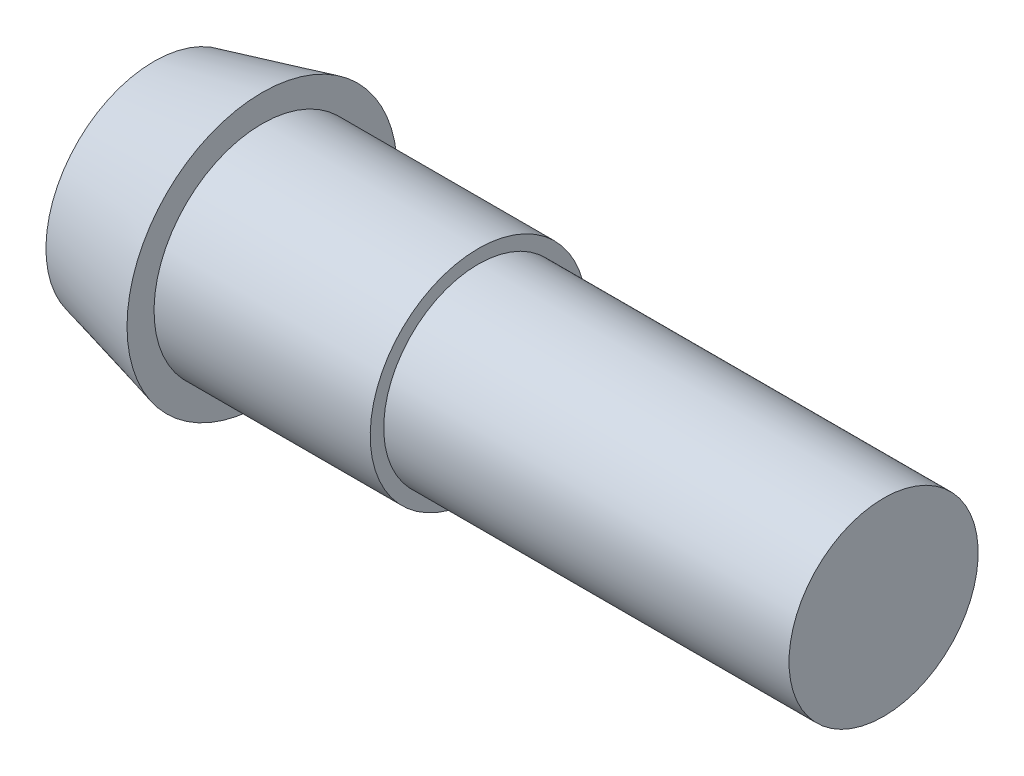
ISO-10303-21;
HEADER;
FILE_DESCRIPTION(('STEP AP214'),'2;1');
FILE_NAME('part.step','',(''),(''),'','','');
FILE_SCHEMA(('AUTOMOTIVE_DESIGN { 1 0 10303 214 1 1 1 1 }'));
ENDSEC;
DATA;
#1=APPLICATION_CONTEXT('core data for automotive mechanical design processes');
#2=APPLICATION_PROTOCOL_DEFINITION('international standard','automotive_design',2000,#1);
#3=PRODUCT_CONTEXT('',#1,'mechanical');
#4=PRODUCT('Part','Part','',(#3));
#5=PRODUCT_RELATED_PRODUCT_CATEGORY('part','',(#4));
#6=PRODUCT_DEFINITION_FORMATION('','',#4);
#7=PRODUCT_DEFINITION_CONTEXT('part definition',#1,'design');
#8=PRODUCT_DEFINITION('design','',#6,#7);
#9=PRODUCT_DEFINITION_SHAPE('','',#8);
#10=(LENGTH_UNIT() NAMED_UNIT(*) SI_UNIT(.MILLI.,.METRE.));
#11=(NAMED_UNIT(*) PLANE_ANGLE_UNIT() SI_UNIT($,.RADIAN.));
#12=(NAMED_UNIT(*) SI_UNIT($,.STERADIAN.) SOLID_ANGLE_UNIT());
#13=UNCERTAINTY_MEASURE_WITH_UNIT(LENGTH_MEASURE(1.E-05),#10,'distance_accuracy_value','');
#14=(GEOMETRIC_REPRESENTATION_CONTEXT(3) GLOBAL_UNCERTAINTY_ASSIGNED_CONTEXT((#13)) GLOBAL_UNIT_ASSIGNED_CONTEXT((#10,
#11,#12)) REPRESENTATION_CONTEXT('',''));
#15=CARTESIAN_POINT('',(0.,0.,0.));
#16=DIRECTION('',(0.,0.,1.));
#17=DIRECTION('',(1.,0.,0.));
#18=AXIS2_PLACEMENT_3D('',#15,#16,#17);
#19=CARTESIAN_POINT('',(0.,0.,0.));
#20=DIRECTION('',(-1.,0.,0.));
#21=DIRECTION('',(0.,-1.,0.));
#22=AXIS2_PLACEMENT_3D('',#19,#20,#21);
#23=PLANE('',#22);
#24=CARTESIAN_POINT('',(0.,0.,0.));
#25=DIRECTION('',(1.,0.,0.));
#26=DIRECTION('',(0.,1.,0.));
#27=AXIS2_PLACEMENT_3D('',#24,#25,#26);
#28=CIRCLE('',#27,4.);
#29=CARTESIAN_POINT('',(0.,4.,0.));
#30=VERTEX_POINT('',#29);
#31=EDGE_CURVE('E10',#30,#30,#28,.T.);
#32=ORIENTED_EDGE('',*,*,#31,.F.);
#33=EDGE_LOOP('',(#32));
#34=FACE_BOUND('',#33,.T.);
#35=ADVANCED_FACE('F34',(#34),#23,.T.);
#36=CARTESIAN_POINT('',(4.,0.,0.));
#37=DIRECTION('',(1.,0.,0.));
#38=DIRECTION('',(0.,1.,0.));
#39=AXIS2_PLACEMENT_3D('',#36,#37,#38);
#40=CONICAL_SURFACE('',#39,5.,0.244978663126864);
#41=ORIENTED_EDGE('',*,*,#31,.T.);
#42=EDGE_LOOP('',(#41));
#43=FACE_BOUND('',#42,.T.);
#44=CARTESIAN_POINT('',(4.,0.,0.));
#45=DIRECTION('',(1.,0.,0.));
#46=DIRECTION('',(0.,1.,0.));
#47=AXIS2_PLACEMENT_3D('',#44,#45,#46);
#48=CIRCLE('',#47,5.);
#49=CARTESIAN_POINT('',(4.,5.,0.));
#50=VERTEX_POINT('',#49);
#51=EDGE_CURVE('E40',#50,#50,#48,.T.);
#52=ORIENTED_EDGE('',*,*,#51,.F.);
#53=EDGE_LOOP('',(#52));
#54=FACE_BOUND('',#53,.T.);
#55=ADVANCED_FACE('F76',(#43,#54),#40,.T.);
#56=CARTESIAN_POINT('',(4.,5.,0.));
#57=DIRECTION('',(1.,0.,0.));
#58=DIRECTION('',(0.,1.,0.));
#59=AXIS2_PLACEMENT_3D('',#56,#57,#58);
#60=PLANE('',#59);
#61=ORIENTED_EDGE('',*,*,#51,.T.);
#62=EDGE_LOOP('',(#61));
#63=FACE_BOUND('',#62,.T.);
#64=CARTESIAN_POINT('',(4.,0.,0.));
#65=DIRECTION('',(1.,0.,0.));
#66=DIRECTION('',(0.,1.,0.));
#67=AXIS2_PLACEMENT_3D('',#64,#65,#66);
#68=CIRCLE('',#67,4.);
#69=CARTESIAN_POINT('',(4.,4.,0.));
#70=VERTEX_POINT('',#69);
#71=EDGE_CURVE('E44',#70,#70,#68,.T.);
#72=ORIENTED_EDGE('',*,*,#71,.F.);
#73=EDGE_LOOP('',(#72));
#74=FACE_BOUND('',#73,.T.);
#75=ADVANCED_FACE('F81',(#63,#74),#60,.T.);
#76=CARTESIAN_POINT('',(27.,0.,0.));
#77=DIRECTION('',(1.,0.,0.));
#78=DIRECTION('',(0.,1.,0.));
#79=AXIS2_PLACEMENT_3D('',#76,#77,#78);
#80=CYLINDRICAL_SURFACE('',#79,4.);
#81=ORIENTED_EDGE('',*,*,#71,.T.);
#82=EDGE_LOOP('',(#81));
#83=FACE_BOUND('',#82,.T.);
#84=CARTESIAN_POINT('',(12.,0.,0.));
#85=DIRECTION('',(1.,0.,0.));
#86=DIRECTION('',(0.,1.,0.));
#87=AXIS2_PLACEMENT_3D('',#84,#85,#86);
#88=CIRCLE('',#87,4.);
#89=CARTESIAN_POINT('',(12.,4.,0.));
#90=VERTEX_POINT('',#89);
#91=EDGE_CURVE('E48',#90,#90,#88,.T.);
#92=ORIENTED_EDGE('',*,*,#91,.F.);
#93=EDGE_LOOP('',(#92));
#94=FACE_BOUND('',#93,.T.);
#95=ADVANCED_FACE('F72',(#83,#94),#80,.T.);
#96=CARTESIAN_POINT('',(12.,4.,0.));
#97=DIRECTION('',(1.,0.,0.));
#98=DIRECTION('',(0.,1.,0.));
#99=AXIS2_PLACEMENT_3D('',#96,#97,#98);
#100=PLANE('',#99);
#101=ORIENTED_EDGE('',*,*,#91,.T.);
#102=EDGE_LOOP('',(#101));
#103=FACE_BOUND('',#102,.T.);
#104=CARTESIAN_POINT('',(12.,0.,0.));
#105=DIRECTION('',(1.,0.,0.));
#106=DIRECTION('',(0.,1.,0.));
#107=AXIS2_PLACEMENT_3D('',#104,#105,#106);
#108=CIRCLE('',#107,3.5);
#109=CARTESIAN_POINT('',(12.,3.5,0.));
#110=VERTEX_POINT('',#109);
#111=EDGE_CURVE('E53',#110,#110,#108,.T.);
#112=ORIENTED_EDGE('',*,*,#111,.F.);
#113=EDGE_LOOP('',(#112));
#114=FACE_BOUND('',#113,.T.);
#115=ADVANCED_FACE('F64',(#103,#114),#100,.T.);
#116=CARTESIAN_POINT('',(27.,0.,0.));
#117=DIRECTION('',(1.,0.,0.));
#118=DIRECTION('',(0.,1.,0.));
#119=AXIS2_PLACEMENT_3D('',#116,#117,#118);
#120=CYLINDRICAL_SURFACE('',#119,3.5);
#121=ORIENTED_EDGE('',*,*,#111,.T.);
#122=EDGE_LOOP('',(#121));
#123=FACE_BOUND('',#122,.T.);
#124=CARTESIAN_POINT('',(27.,0.,0.));
#125=DIRECTION('',(1.,0.,0.));
#126=DIRECTION('',(0.,1.,0.));
#127=AXIS2_PLACEMENT_3D('',#124,#125,#126);
#128=CIRCLE('',#127,3.5);
#129=CARTESIAN_POINT('',(27.,3.5,0.));
#130=VERTEX_POINT('',#129);
#131=EDGE_CURVE('E56',#130,#130,#128,.T.);
#132=ORIENTED_EDGE('',*,*,#131,.F.);
#133=EDGE_LOOP('',(#132));
#134=FACE_BOUND('',#133,.T.);
#135=ADVANCED_FACE('F62',(#123,#134),#120,.T.);
#136=CARTESIAN_POINT('',(27.,3.5,0.));
#137=DIRECTION('',(1.,0.,0.));
#138=DIRECTION('',(0.,1.,0.));
#139=AXIS2_PLACEMENT_3D('',#136,#137,#138);
#140=PLANE('',#139);
#141=ORIENTED_EDGE('',*,*,#131,.T.);
#142=EDGE_LOOP('',(#141));
#143=FACE_BOUND('',#142,.T.);
#144=ADVANCED_FACE('F60',(#143),#140,.T.);
#145=CLOSED_SHELL('',(#35,#55,#75,#95,#115,#135,#144));
#146=MANIFOLD_SOLID_BREP('B2',#145);
#147=ADVANCED_BREP_SHAPE_REPRESENTATION('',(#18,#146),#14);
#148=SHAPE_DEFINITION_REPRESENTATION(#9,#147);
ENDSEC;
END-ISO-10303-21;
